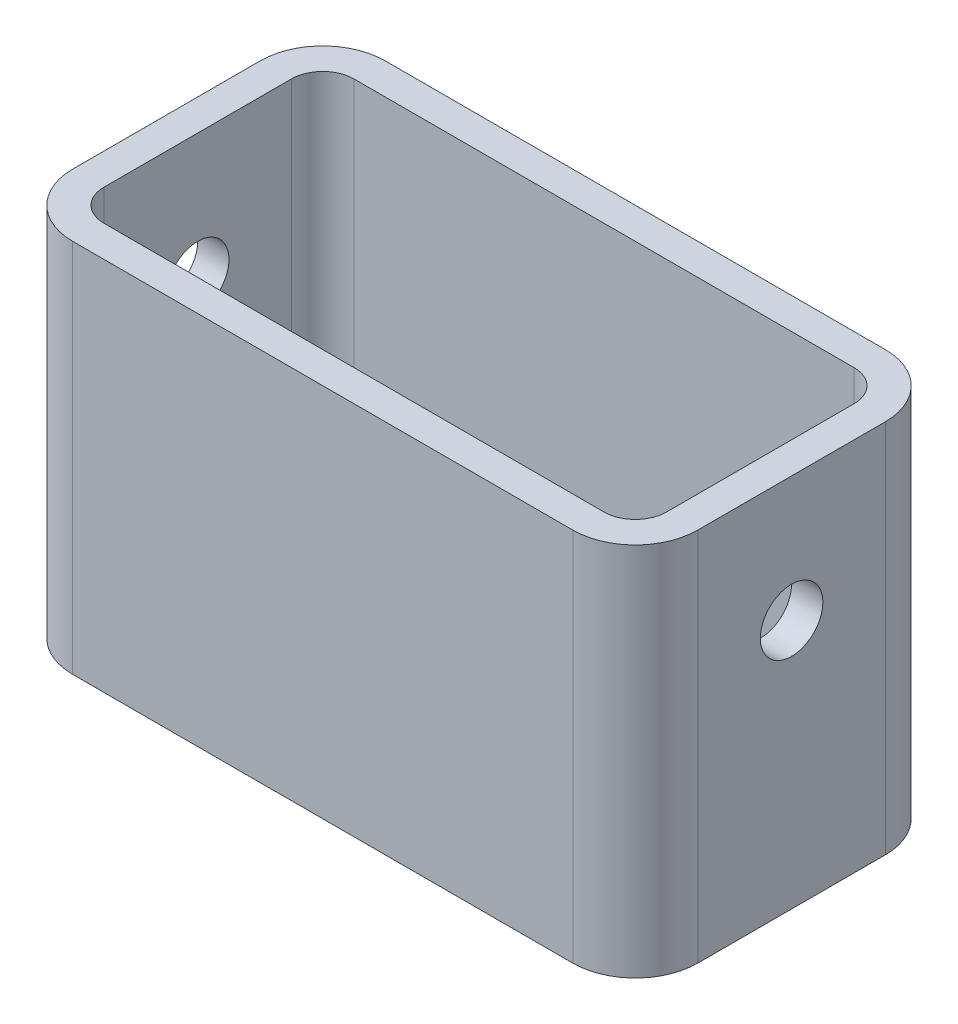
ISO-10303-21;
HEADER;
FILE_DESCRIPTION(('STEP AP214'),'2;1');
FILE_NAME('part.step','',(''),(''),'','','');
FILE_SCHEMA(('AUTOMOTIVE_DESIGN { 1 0 10303 214 1 1 1 1 }'));
ENDSEC;
DATA;
#1=APPLICATION_CONTEXT('core data for automotive mechanical design processes');
#2=APPLICATION_PROTOCOL_DEFINITION('international standard','automotive_design',2000,#1);
#3=PRODUCT_CONTEXT('',#1,'mechanical');
#4=PRODUCT('Part','Part','',(#3));
#5=PRODUCT_RELATED_PRODUCT_CATEGORY('part','',(#4));
#6=PRODUCT_DEFINITION_FORMATION('','',#4);
#7=PRODUCT_DEFINITION_CONTEXT('part definition',#1,'design');
#8=PRODUCT_DEFINITION('design','',#6,#7);
#9=PRODUCT_DEFINITION_SHAPE('','',#8);
#10=(LENGTH_UNIT() NAMED_UNIT(*) SI_UNIT(.MILLI.,.METRE.));
#11=(NAMED_UNIT(*) PLANE_ANGLE_UNIT() SI_UNIT($,.RADIAN.));
#12=(NAMED_UNIT(*) SI_UNIT($,.STERADIAN.) SOLID_ANGLE_UNIT());
#13=UNCERTAINTY_MEASURE_WITH_UNIT(LENGTH_MEASURE(1.E-05),#10,'distance_accuracy_value','');
#14=(GEOMETRIC_REPRESENTATION_CONTEXT(3) GLOBAL_UNCERTAINTY_ASSIGNED_CONTEXT((#13)) GLOBAL_UNIT_ASSIGNED_CONTEXT((#10,
#11,#12)) REPRESENTATION_CONTEXT('',''));
#15=CARTESIAN_POINT('',(0.,0.,0.));
#16=DIRECTION('',(0.,0.,1.));
#17=DIRECTION('',(1.,0.,0.));
#18=AXIS2_PLACEMENT_3D('',#15,#16,#17);
#19=CARTESIAN_POINT('',(0.,60.,0.));
#20=DIRECTION('',(1.,0.,0.));
#21=DIRECTION('',(0.,0.,-1.));
#22=AXIS2_PLACEMENT_3D('',#19,#20,#21);
#23=PLANE('',#22);
#24=CARTESIAN_POINT('',(0.,40.,-25.));
#25=DIRECTION('',(-1.,0.,0.));
#26=DIRECTION('',(0.,0.,1.));
#27=AXIS2_PLACEMENT_3D('',#24,#25,#26);
#28=CIRCLE('',#27,5.);
#29=CARTESIAN_POINT('',(0.,40.,-20.));
#30=VERTEX_POINT('',#29);
#31=EDGE_CURVE('E324',#30,#30,#28,.T.);
#32=ORIENTED_EDGE('',*,*,#31,.F.);
#33=EDGE_LOOP('',(#32));
#34=FACE_BOUND('',#33,.T.);
#35=DIRECTION('',(0.,0.,1.));
#36=VECTOR('',#35,1.);
#37=CARTESIAN_POINT('',(0.,0.,0.));
#38=LINE('',#37,#36);
#39=CARTESIAN_POINT('',(0.,0.,-40.));
#40=VERTEX_POINT('',#39);
#41=CARTESIAN_POINT('',(0.,0.,-10.));
#42=VERTEX_POINT('',#41);
#43=EDGE_CURVE('E163',#40,#42,#38,.T.);
#44=ORIENTED_EDGE('',*,*,#43,.T.);
#45=DIRECTION('',(0.,-1.,0.));
#46=VECTOR('',#45,1.);
#47=CARTESIAN_POINT('',(0.,60.,-10.));
#48=LINE('',#47,#46);
#49=CARTESIAN_POINT('',(0.,60.,-10.));
#50=VERTEX_POINT('',#49);
#51=EDGE_CURVE('E267',#42,#50,#48,.F.);
#52=ORIENTED_EDGE('',*,*,#51,.T.);
#53=DIRECTION('',(0.,0.,1.));
#54=VECTOR('',#53,1.);
#55=CARTESIAN_POINT('',(0.,60.,0.));
#56=LINE('',#55,#54);
#57=CARTESIAN_POINT('',(0.,60.,-40.));
#58=VERTEX_POINT('',#57);
#59=EDGE_CURVE('E228',#58,#50,#56,.T.);
#60=ORIENTED_EDGE('',*,*,#59,.F.);
#61=DIRECTION('',(0.,-1.,0.));
#62=VECTOR('',#61,1.);
#63=CARTESIAN_POINT('',(0.,60.,-40.));
#64=LINE('',#63,#62);
#65=EDGE_CURVE('E264',#58,#40,#64,.T.);
#66=ORIENTED_EDGE('',*,*,#65,.T.);
#67=EDGE_LOOP('',(#44,#52,#60,#66));
#68=FACE_BOUND('',#67,.T.);
#69=ADVANCED_FACE('F34',(#34,#68),#23,.F.);
#70=CARTESIAN_POINT('',(0.,60.,0.));
#71=DIRECTION('',(0.,0.,-1.));
#72=DIRECTION('',(-1.,0.,0.));
#73=AXIS2_PLACEMENT_3D('',#70,#71,#72);
#74=PLANE('',#73);
#75=DIRECTION('',(1.,0.,0.));
#76=VECTOR('',#75,1.);
#77=CARTESIAN_POINT('',(0.,60.,0.));
#78=LINE('',#77,#76);
#79=CARTESIAN_POINT('',(10.,60.,0.));
#80=VERTEX_POINT('',#79);
#81=CARTESIAN_POINT('',(90.,60.,0.));
#82=VERTEX_POINT('',#81);
#83=EDGE_CURVE('E231',#80,#82,#78,.T.);
#84=ORIENTED_EDGE('',*,*,#83,.F.);
#85=DIRECTION('',(0.,-1.,0.));
#86=VECTOR('',#85,1.);
#87=CARTESIAN_POINT('',(10.,60.,0.));
#88=LINE('',#87,#86);
#89=CARTESIAN_POINT('',(10.,0.,0.));
#90=VERTEX_POINT('',#89);
#91=EDGE_CURVE('E253',#80,#90,#88,.T.);
#92=ORIENTED_EDGE('',*,*,#91,.T.);
#93=DIRECTION('',(1.,0.,0.));
#94=VECTOR('',#93,1.);
#95=CARTESIAN_POINT('',(0.,0.,0.));
#96=LINE('',#95,#94);
#97=CARTESIAN_POINT('',(90.,0.,0.));
#98=VERTEX_POINT('',#97);
#99=EDGE_CURVE('E244',#90,#98,#96,.T.);
#100=ORIENTED_EDGE('',*,*,#99,.T.);
#101=DIRECTION('',(0.,-1.,0.));
#102=VECTOR('',#101,1.);
#103=CARTESIAN_POINT('',(90.,60.,0.));
#104=LINE('',#103,#102);
#105=EDGE_CURVE('E241',#98,#82,#104,.F.);
#106=ORIENTED_EDGE('',*,*,#105,.T.);
#107=EDGE_LOOP('',(#84,#92,#100,#106));
#108=FACE_BOUND('',#107,.T.);
#109=ADVANCED_FACE('F361',(#108),#74,.F.);
#110=CARTESIAN_POINT('',(100.,60.,0.));
#111=DIRECTION('',(-1.,0.,0.));
#112=DIRECTION('',(0.,0.,1.));
#113=AXIS2_PLACEMENT_3D('',#110,#111,#112);
#114=PLANE('',#113);
#115=CARTESIAN_POINT('',(100.,40.,-25.));
#116=DIRECTION('',(-1.,0.,0.));
#117=DIRECTION('',(0.,0.,1.));
#118=AXIS2_PLACEMENT_3D('',#115,#116,#117);
#119=CIRCLE('',#118,5.);
#120=CARTESIAN_POINT('',(100.,40.,-20.));
#121=VERTEX_POINT('',#120);
#122=EDGE_CURVE('E327',#121,#121,#119,.T.);
#123=ORIENTED_EDGE('',*,*,#122,.T.);
#124=EDGE_LOOP('',(#123));
#125=FACE_BOUND('',#124,.T.);
#126=DIRECTION('',(0.,0.,-1.));
#127=VECTOR('',#126,1.);
#128=CARTESIAN_POINT('',(100.,60.,0.));
#129=LINE('',#128,#127);
#130=CARTESIAN_POINT('',(100.,60.,-10.));
#131=VERTEX_POINT('',#130);
#132=CARTESIAN_POINT('',(100.,60.,-40.));
#133=VERTEX_POINT('',#132);
#134=EDGE_CURVE('E235',#131,#133,#129,.T.);
#135=ORIENTED_EDGE('',*,*,#134,.F.);
#136=DIRECTION('',(0.,-1.,0.));
#137=VECTOR('',#136,1.);
#138=CARTESIAN_POINT('',(100.,60.,-10.));
#139=LINE('',#138,#137);
#140=CARTESIAN_POINT('',(100.,0.,-10.));
#141=VERTEX_POINT('',#140);
#142=EDGE_CURVE('E284',#131,#141,#139,.T.);
#143=ORIENTED_EDGE('',*,*,#142,.T.);
#144=DIRECTION('',(0.,0.,-1.));
#145=VECTOR('',#144,1.);
#146=CARTESIAN_POINT('',(100.,0.,0.));
#147=LINE('',#146,#145);
#148=CARTESIAN_POINT('',(100.,0.,-40.));
#149=VERTEX_POINT('',#148);
#150=EDGE_CURVE('E247',#141,#149,#147,.T.);
#151=ORIENTED_EDGE('',*,*,#150,.T.);
#152=DIRECTION('',(0.,-1.,0.));
#153=VECTOR('',#152,1.);
#154=CARTESIAN_POINT('',(100.,60.,-40.));
#155=LINE('',#154,#153);
#156=EDGE_CURVE('E282',#149,#133,#155,.F.);
#157=ORIENTED_EDGE('',*,*,#156,.T.);
#158=EDGE_LOOP('',(#135,#143,#151,#157));
#159=FACE_BOUND('',#158,.T.);
#160=ADVANCED_FACE('F367',(#125,#159),#114,.F.);
#161=CARTESIAN_POINT('',(0.,60.,-50.));
#162=DIRECTION('',(0.,0.,1.));
#163=DIRECTION('',(1.,0.,0.));
#164=AXIS2_PLACEMENT_3D('',#161,#162,#163);
#165=PLANE('',#164);
#166=DIRECTION('',(-1.,0.,0.));
#167=VECTOR('',#166,1.);
#168=CARTESIAN_POINT('',(0.,0.,-50.));
#169=LINE('',#168,#167);
#170=CARTESIAN_POINT('',(90.,0.,-50.));
#171=VERTEX_POINT('',#170);
#172=CARTESIAN_POINT('',(10.,0.,-50.));
#173=VERTEX_POINT('',#172);
#174=EDGE_CURVE('E232',#171,#173,#169,.T.);
#175=ORIENTED_EDGE('',*,*,#174,.T.);
#176=DIRECTION('',(0.,-1.,0.));
#177=VECTOR('',#176,1.);
#178=CARTESIAN_POINT('',(10.,60.,-50.));
#179=LINE('',#178,#177);
#180=CARTESIAN_POINT('',(10.,60.,-50.));
#181=VERTEX_POINT('',#180);
#182=EDGE_CURVE('E280',#173,#181,#179,.F.);
#183=ORIENTED_EDGE('',*,*,#182,.T.);
#184=DIRECTION('',(-1.,0.,0.));
#185=VECTOR('',#184,1.);
#186=CARTESIAN_POINT('',(0.,60.,-50.));
#187=LINE('',#186,#185);
#188=CARTESIAN_POINT('',(90.,60.,-50.));
#189=VERTEX_POINT('',#188);
#190=EDGE_CURVE('E238',#189,#181,#187,.T.);
#191=ORIENTED_EDGE('',*,*,#190,.F.);
#192=DIRECTION('',(0.,-1.,0.));
#193=VECTOR('',#192,1.);
#194=CARTESIAN_POINT('',(90.,60.,-50.));
#195=LINE('',#194,#193);
#196=EDGE_CURVE('E277',#189,#171,#195,.T.);
#197=ORIENTED_EDGE('',*,*,#196,.T.);
#198=EDGE_LOOP('',(#175,#183,#191,#197));
#199=FACE_BOUND('',#198,.T.);
#200=ADVANCED_FACE('F398',(#199),#165,.F.);
#201=CARTESIAN_POINT('',(0.,60.,0.));
#202=DIRECTION('',(0.,-1.,0.));
#203=DIRECTION('',(0.,0.,-1.));
#204=AXIS2_PLACEMENT_3D('',#201,#202,#203);
#205=PLANE('',#204);
#206=DIRECTION('',(0.,0.,1.));
#207=VECTOR('',#206,1.);
#208=CARTESIAN_POINT('',(5.,60.,-40.));
#209=LINE('',#208,#207);
#210=CARTESIAN_POINT('',(5.,60.,-40.));
#211=VERTEX_POINT('',#210);
#212=CARTESIAN_POINT('',(5.,60.,-10.));
#213=VERTEX_POINT('',#212);
#214=EDGE_CURVE('E50',#211,#213,#209,.T.);
#215=ORIENTED_EDGE('',*,*,#214,.F.);
#216=CARTESIAN_POINT('',(10.,60.,-40.));
#217=DIRECTION('',(0.,1.,0.));
#218=DIRECTION('',(0.,0.,1.));
#219=AXIS2_PLACEMENT_3D('',#216,#217,#218);
#220=CIRCLE('',#219,5.);
#221=CARTESIAN_POINT('',(10.,60.,-45.));
#222=VERTEX_POINT('',#221);
#223=EDGE_CURVE('E206',#222,#211,#220,.T.);
#224=ORIENTED_EDGE('',*,*,#223,.F.);
#225=DIRECTION('',(-1.,0.,0.));
#226=VECTOR('',#225,1.);
#227=CARTESIAN_POINT('',(90.,60.,-45.));
#228=LINE('',#227,#226);
#229=CARTESIAN_POINT('',(90.,60.,-45.));
#230=VERTEX_POINT('',#229);
#231=EDGE_CURVE('E196',#230,#222,#228,.T.);
#232=ORIENTED_EDGE('',*,*,#231,.F.);
#233=CARTESIAN_POINT('',(90.,60.,-40.));
#234=DIRECTION('',(0.,1.,0.));
#235=DIRECTION('',(0.,0.,1.));
#236=AXIS2_PLACEMENT_3D('',#233,#234,#235);
#237=CIRCLE('',#236,5.);
#238=CARTESIAN_POINT('',(95.,60.,-40.));
#239=VERTEX_POINT('',#238);
#240=EDGE_CURVE('E186',#239,#230,#237,.T.);
#241=ORIENTED_EDGE('',*,*,#240,.F.);
#242=DIRECTION('',(0.,0.,-1.));
#243=VECTOR('',#242,1.);
#244=CARTESIAN_POINT('',(95.,60.,-10.));
#245=LINE('',#244,#243);
#246=CARTESIAN_POINT('',(95.,60.,-10.));
#247=VERTEX_POINT('',#246);
#248=EDGE_CURVE('E177',#247,#239,#245,.T.);
#249=ORIENTED_EDGE('',*,*,#248,.F.);
#250=CARTESIAN_POINT('',(90.,60.,-10.));
#251=DIRECTION('',(0.,1.,0.));
#252=DIRECTION('',(0.,0.,1.));
#253=AXIS2_PLACEMENT_3D('',#250,#251,#252);
#254=CIRCLE('',#253,5.);
#255=CARTESIAN_POINT('',(90.,60.,-5.));
#256=VERTEX_POINT('',#255);
#257=EDGE_CURVE('E156',#256,#247,#254,.T.);
#258=ORIENTED_EDGE('',*,*,#257,.F.);
#259=DIRECTION('',(1.,0.,0.));
#260=VECTOR('',#259,1.);
#261=CARTESIAN_POINT('',(10.,60.,-5.));
#262=LINE('',#261,#260);
#263=CARTESIAN_POINT('',(10.,60.,-5.));
#264=VERTEX_POINT('',#263);
#265=EDGE_CURVE('E151',#264,#256,#262,.T.);
#266=ORIENTED_EDGE('',*,*,#265,.F.);
#267=CARTESIAN_POINT('',(10.,60.,-10.));
#268=DIRECTION('',(0.,1.,0.));
#269=DIRECTION('',(0.,0.,1.));
#270=AXIS2_PLACEMENT_3D('',#267,#268,#269);
#271=CIRCLE('',#270,5.);
#272=EDGE_CURVE('E159',#213,#264,#271,.T.);
#273=ORIENTED_EDGE('',*,*,#272,.F.);
#274=EDGE_LOOP('',(#215,#224,#232,#241,#249,#258,#266,#273));
#275=FACE_BOUND('',#274,.T.);
#276=ORIENTED_EDGE('',*,*,#59,.T.);
#277=CARTESIAN_POINT('',(10.,60.,-10.));
#278=DIRECTION('',(0.,-1.,0.));
#279=DIRECTION('',(0.,0.,-1.));
#280=AXIS2_PLACEMENT_3D('',#277,#278,#279);
#281=CIRCLE('',#280,10.);
#282=EDGE_CURVE('E275',#50,#80,#281,.F.);
#283=ORIENTED_EDGE('',*,*,#282,.T.);
#284=ORIENTED_EDGE('',*,*,#83,.T.);
#285=CARTESIAN_POINT('',(90.,60.,-10.));
#286=DIRECTION('',(0.,-1.,0.));
#287=DIRECTION('',(0.,0.,-1.));
#288=AXIS2_PLACEMENT_3D('',#285,#286,#287);
#289=CIRCLE('',#288,10.);
#290=EDGE_CURVE('E271',#82,#131,#289,.F.);
#291=ORIENTED_EDGE('',*,*,#290,.T.);
#292=ORIENTED_EDGE('',*,*,#134,.T.);
#293=CARTESIAN_POINT('',(90.,60.,-40.));
#294=DIRECTION('',(0.,-1.,0.));
#295=DIRECTION('',(0.,0.,-1.));
#296=AXIS2_PLACEMENT_3D('',#293,#294,#295);
#297=CIRCLE('',#296,10.);
#298=EDGE_CURVE('E269',#133,#189,#297,.F.);
#299=ORIENTED_EDGE('',*,*,#298,.T.);
#300=ORIENTED_EDGE('',*,*,#190,.T.);
#301=CARTESIAN_POINT('',(10.,60.,-40.));
#302=DIRECTION('',(0.,-1.,0.));
#303=DIRECTION('',(0.,0.,-1.));
#304=AXIS2_PLACEMENT_3D('',#301,#302,#303);
#305=CIRCLE('',#304,10.);
#306=EDGE_CURVE('E273',#181,#58,#305,.F.);
#307=ORIENTED_EDGE('',*,*,#306,.T.);
#308=EDGE_LOOP('',(#276,#283,#284,#291,#292,#299,#300,#307));
#309=FACE_BOUND('',#308,.T.);
#310=ADVANCED_FACE('F165',(#275,#309),#205,.F.);
#311=CARTESIAN_POINT('',(0.,0.,0.));
#312=DIRECTION('',(0.,-1.,0.));
#313=DIRECTION('',(0.,0.,-1.));
#314=AXIS2_PLACEMENT_3D('',#311,#312,#313);
#315=PLANE('',#314);
#316=CARTESIAN_POINT('',(10.,0.,-40.));
#317=DIRECTION('',(0.,-1.,0.));
#318=DIRECTION('',(0.,0.,-1.));
#319=AXIS2_PLACEMENT_3D('',#316,#317,#318);
#320=CIRCLE('',#319,5.);
#321=CARTESIAN_POINT('',(10.,0.,-45.));
#322=VERTEX_POINT('',#321);
#323=CARTESIAN_POINT('',(5.,0.,-40.));
#324=VERTEX_POINT('',#323);
#325=EDGE_CURVE('E43',#322,#324,#320,.F.);
#326=ORIENTED_EDGE('',*,*,#325,.T.);
#327=DIRECTION('',(0.,0.,1.));
#328=VECTOR('',#327,1.);
#329=CARTESIAN_POINT('',(5.,0.,0.));
#330=LINE('',#329,#328);
#331=CARTESIAN_POINT('',(5.,0.,-10.));
#332=VERTEX_POINT('',#331);
#333=EDGE_CURVE('E12',#324,#332,#330,.T.);
#334=ORIENTED_EDGE('',*,*,#333,.T.);
#335=CARTESIAN_POINT('',(10.,0.,-10.));
#336=DIRECTION('',(0.,-1.,0.));
#337=DIRECTION('',(0.,0.,-1.));
#338=AXIS2_PLACEMENT_3D('',#335,#336,#337);
#339=CIRCLE('',#338,5.);
#340=CARTESIAN_POINT('',(10.,0.,-5.));
#341=VERTEX_POINT('',#340);
#342=EDGE_CURVE('E287',#332,#341,#339,.F.);
#343=ORIENTED_EDGE('',*,*,#342,.T.);
#344=DIRECTION('',(1.,0.,0.));
#345=VECTOR('',#344,1.);
#346=CARTESIAN_POINT('',(0.,0.,-5.));
#347=LINE('',#346,#345);
#348=CARTESIAN_POINT('',(90.,0.,-5.));
#349=VERTEX_POINT('',#348);
#350=EDGE_CURVE('E154',#341,#349,#347,.T.);
#351=ORIENTED_EDGE('',*,*,#350,.T.);
#352=CARTESIAN_POINT('',(90.,0.,-10.));
#353=DIRECTION('',(0.,-1.,0.));
#354=DIRECTION('',(0.,0.,-1.));
#355=AXIS2_PLACEMENT_3D('',#352,#353,#354);
#356=CIRCLE('',#355,5.);
#357=CARTESIAN_POINT('',(95.,0.,-10.));
#358=VERTEX_POINT('',#357);
#359=EDGE_CURVE('E290',#349,#358,#356,.F.);
#360=ORIENTED_EDGE('',*,*,#359,.T.);
#361=DIRECTION('',(0.,0.,-1.));
#362=VECTOR('',#361,1.);
#363=CARTESIAN_POINT('',(95.,0.,0.));
#364=LINE('',#363,#362);
#365=CARTESIAN_POINT('',(95.,0.,-40.));
#366=VERTEX_POINT('',#365);
#367=EDGE_CURVE('E293',#358,#366,#364,.T.);
#368=ORIENTED_EDGE('',*,*,#367,.T.);
#369=CARTESIAN_POINT('',(90.,0.,-40.));
#370=DIRECTION('',(0.,-1.,0.));
#371=DIRECTION('',(0.,0.,-1.));
#372=AXIS2_PLACEMENT_3D('',#369,#370,#371);
#373=CIRCLE('',#372,5.);
#374=CARTESIAN_POINT('',(90.,0.,-45.));
#375=VERTEX_POINT('',#374);
#376=EDGE_CURVE('E296',#366,#375,#373,.F.);
#377=ORIENTED_EDGE('',*,*,#376,.T.);
#378=DIRECTION('',(-1.,0.,0.));
#379=VECTOR('',#378,1.);
#380=CARTESIAN_POINT('',(0.,0.,-45.));
#381=LINE('',#380,#379);
#382=EDGE_CURVE('E299',#375,#322,#381,.T.);
#383=ORIENTED_EDGE('',*,*,#382,.T.);
#384=EDGE_LOOP('',(#326,#334,#343,#351,#360,#368,#377,#383));
#385=FACE_BOUND('',#384,.T.);
#386=ORIENTED_EDGE('',*,*,#99,.F.);
#387=CARTESIAN_POINT('',(10.,0.,-10.));
#388=DIRECTION('',(0.,-1.,0.));
#389=DIRECTION('',(0.,0.,-1.));
#390=AXIS2_PLACEMENT_3D('',#387,#388,#389);
#391=CIRCLE('',#390,10.);
#392=EDGE_CURVE('E262',#90,#42,#391,.T.);
#393=ORIENTED_EDGE('',*,*,#392,.T.);
#394=ORIENTED_EDGE('',*,*,#43,.F.);
#395=CARTESIAN_POINT('',(10.,0.,-40.));
#396=DIRECTION('',(0.,-1.,0.));
#397=DIRECTION('',(0.,0.,-1.));
#398=AXIS2_PLACEMENT_3D('',#395,#396,#397);
#399=CIRCLE('',#398,10.);
#400=EDGE_CURVE('E260',#40,#173,#399,.T.);
#401=ORIENTED_EDGE('',*,*,#400,.T.);
#402=ORIENTED_EDGE('',*,*,#174,.F.);
#403=CARTESIAN_POINT('',(90.,0.,-40.));
#404=DIRECTION('',(0.,-1.,0.));
#405=DIRECTION('',(0.,0.,-1.));
#406=AXIS2_PLACEMENT_3D('',#403,#404,#405);
#407=CIRCLE('',#406,10.);
#408=EDGE_CURVE('E256',#171,#149,#407,.T.);
#409=ORIENTED_EDGE('',*,*,#408,.T.);
#410=ORIENTED_EDGE('',*,*,#150,.F.);
#411=CARTESIAN_POINT('',(90.,0.,-10.));
#412=DIRECTION('',(0.,-1.,0.));
#413=DIRECTION('',(0.,0.,-1.));
#414=AXIS2_PLACEMENT_3D('',#411,#412,#413);
#415=CIRCLE('',#414,10.);
#416=EDGE_CURVE('E258',#141,#98,#415,.T.);
#417=ORIENTED_EDGE('',*,*,#416,.T.);
#418=EDGE_LOOP('',(#386,#393,#394,#401,#402,#409,#410,#417));
#419=FACE_BOUND('',#418,.T.);
#420=ADVANCED_FACE('F304',(#385,#419),#315,.T.);
#421=CARTESIAN_POINT('',(10.,60.,-10.));
#422=DIRECTION('',(0.,-1.,0.));
#423=DIRECTION('',(0.,0.,-1.));
#424=AXIS2_PLACEMENT_3D('',#421,#422,#423);
#425=CYLINDRICAL_SURFACE('',#424,10.);
#426=ORIENTED_EDGE('',*,*,#282,.F.);
#427=ORIENTED_EDGE('',*,*,#51,.F.);
#428=ORIENTED_EDGE('',*,*,#392,.F.);
#429=ORIENTED_EDGE('',*,*,#91,.F.);
#430=EDGE_LOOP('',(#426,#427,#428,#429));
#431=FACE_BOUND('',#430,.T.);
#432=ADVANCED_FACE('F374',(#431),#425,.T.);
#433=CARTESIAN_POINT('',(10.,60.,-40.));
#434=DIRECTION('',(0.,-1.,0.));
#435=DIRECTION('',(0.,0.,-1.));
#436=AXIS2_PLACEMENT_3D('',#433,#434,#435);
#437=CYLINDRICAL_SURFACE('',#436,10.);
#438=ORIENTED_EDGE('',*,*,#306,.F.);
#439=ORIENTED_EDGE('',*,*,#182,.F.);
#440=ORIENTED_EDGE('',*,*,#400,.F.);
#441=ORIENTED_EDGE('',*,*,#65,.F.);
#442=EDGE_LOOP('',(#438,#439,#440,#441));
#443=FACE_BOUND('',#442,.T.);
#444=ADVANCED_FACE('F377',(#443),#437,.T.);
#445=CARTESIAN_POINT('',(90.,60.,-10.));
#446=DIRECTION('',(0.,-1.,0.));
#447=DIRECTION('',(0.,0.,-1.));
#448=AXIS2_PLACEMENT_3D('',#445,#446,#447);
#449=CYLINDRICAL_SURFACE('',#448,10.);
#450=ORIENTED_EDGE('',*,*,#290,.F.);
#451=ORIENTED_EDGE('',*,*,#105,.F.);
#452=ORIENTED_EDGE('',*,*,#416,.F.);
#453=ORIENTED_EDGE('',*,*,#142,.F.);
#454=EDGE_LOOP('',(#450,#451,#452,#453));
#455=FACE_BOUND('',#454,.T.);
#456=ADVANCED_FACE('F354',(#455),#449,.T.);
#457=CARTESIAN_POINT('',(90.,60.,-40.));
#458=DIRECTION('',(0.,-1.,0.));
#459=DIRECTION('',(0.,0.,-1.));
#460=AXIS2_PLACEMENT_3D('',#457,#458,#459);
#461=CYLINDRICAL_SURFACE('',#460,10.);
#462=ORIENTED_EDGE('',*,*,#298,.F.);
#463=ORIENTED_EDGE('',*,*,#156,.F.);
#464=ORIENTED_EDGE('',*,*,#408,.F.);
#465=ORIENTED_EDGE('',*,*,#196,.F.);
#466=EDGE_LOOP('',(#462,#463,#464,#465));
#467=FACE_BOUND('',#466,.T.);
#468=ADVANCED_FACE('F36',(#467),#461,.T.);
#469=CARTESIAN_POINT('',(5.,60.,-40.));
#470=DIRECTION('',(1.,0.,0.));
#471=DIRECTION('',(0.,0.,-1.));
#472=AXIS2_PLACEMENT_3D('',#469,#470,#471);
#473=PLANE('',#472);
#474=CARTESIAN_POINT('',(5.,40.,-25.));
#475=DIRECTION('',(1.,0.,0.));
#476=DIRECTION('',(0.,0.,-1.));
#477=AXIS2_PLACEMENT_3D('',#474,#475,#476);
#478=CIRCLE('',#477,5.);
#479=CARTESIAN_POINT('',(5.,40.,-30.));
#480=VERTEX_POINT('',#479);
#481=EDGE_CURVE('E225',#480,#480,#478,.T.);
#482=ORIENTED_EDGE('',*,*,#481,.F.);
#483=EDGE_LOOP('',(#482));
#484=FACE_BOUND('',#483,.T.);
#485=DIRECTION('',(0.,-1.,0.));
#486=VECTOR('',#485,1.);
#487=CARTESIAN_POINT('',(5.,60.,-40.));
#488=LINE('',#487,#486);
#489=EDGE_CURVE('E222',#211,#324,#488,.T.);
#490=ORIENTED_EDGE('',*,*,#489,.F.);
#491=ORIENTED_EDGE('',*,*,#214,.T.);
#492=DIRECTION('',(0.,-1.,0.));
#493=VECTOR('',#492,1.);
#494=CARTESIAN_POINT('',(5.,60.,-10.));
#495=LINE('',#494,#493);
#496=EDGE_CURVE('E161',#213,#332,#495,.T.);
#497=ORIENTED_EDGE('',*,*,#496,.T.);
#498=ORIENTED_EDGE('',*,*,#333,.F.);
#499=EDGE_LOOP('',(#490,#491,#497,#498));
#500=FACE_BOUND('',#499,.T.);
#501=ADVANCED_FACE('F345',(#484,#500),#473,.T.);
#502=CARTESIAN_POINT('',(10.,60.,-40.));
#503=DIRECTION('',(0.,-1.,0.));
#504=DIRECTION('',(0.,0.,-1.));
#505=AXIS2_PLACEMENT_3D('',#502,#503,#504);
#506=CYLINDRICAL_SURFACE('',#505,5.);
#507=DIRECTION('',(0.,-1.,0.));
#508=VECTOR('',#507,1.);
#509=CARTESIAN_POINT('',(10.,60.,-45.));
#510=LINE('',#509,#508);
#511=EDGE_CURVE('E213',#222,#322,#510,.T.);
#512=ORIENTED_EDGE('',*,*,#511,.F.);
#513=ORIENTED_EDGE('',*,*,#223,.T.);
#514=ORIENTED_EDGE('',*,*,#489,.T.);
#515=ORIENTED_EDGE('',*,*,#325,.F.);
#516=EDGE_LOOP('',(#512,#513,#514,#515));
#517=FACE_BOUND('',#516,.T.);
#518=ADVANCED_FACE('F307',(#517),#506,.F.);
#519=CARTESIAN_POINT('',(90.,60.,-45.));
#520=DIRECTION('',(0.,0.,1.));
#521=DIRECTION('',(1.,0.,0.));
#522=AXIS2_PLACEMENT_3D('',#519,#520,#521);
#523=PLANE('',#522);
#524=DIRECTION('',(0.,-1.,0.));
#525=VECTOR('',#524,1.);
#526=CARTESIAN_POINT('',(90.,60.,-45.));
#527=LINE('',#526,#525);
#528=EDGE_CURVE('E203',#230,#375,#527,.T.);
#529=ORIENTED_EDGE('',*,*,#528,.F.);
#530=ORIENTED_EDGE('',*,*,#231,.T.);
#531=ORIENTED_EDGE('',*,*,#511,.T.);
#532=ORIENTED_EDGE('',*,*,#382,.F.);
#533=EDGE_LOOP('',(#529,#530,#531,#532));
#534=FACE_BOUND('',#533,.T.);
#535=ADVANCED_FACE('F309',(#534),#523,.T.);
#536=CARTESIAN_POINT('',(90.,60.,-40.));
#537=DIRECTION('',(0.,-1.,0.));
#538=DIRECTION('',(0.,0.,-1.));
#539=AXIS2_PLACEMENT_3D('',#536,#537,#538);
#540=CYLINDRICAL_SURFACE('',#539,5.);
#541=DIRECTION('',(0.,-1.,0.));
#542=VECTOR('',#541,1.);
#543=CARTESIAN_POINT('',(95.,60.,-40.));
#544=LINE('',#543,#542);
#545=EDGE_CURVE('E193',#239,#366,#544,.T.);
#546=ORIENTED_EDGE('',*,*,#545,.F.);
#547=ORIENTED_EDGE('',*,*,#240,.T.);
#548=ORIENTED_EDGE('',*,*,#528,.T.);
#549=ORIENTED_EDGE('',*,*,#376,.F.);
#550=EDGE_LOOP('',(#546,#547,#548,#549));
#551=FACE_BOUND('',#550,.T.);
#552=ADVANCED_FACE('F341',(#551),#540,.F.);
#553=CARTESIAN_POINT('',(95.,60.,-10.));
#554=DIRECTION('',(-1.,0.,0.));
#555=DIRECTION('',(0.,0.,1.));
#556=AXIS2_PLACEMENT_3D('',#553,#554,#555);
#557=PLANE('',#556);
#558=CARTESIAN_POINT('',(95.,40.,-25.));
#559=DIRECTION('',(-1.,0.,0.));
#560=DIRECTION('',(0.,0.,1.));
#561=AXIS2_PLACEMENT_3D('',#558,#559,#560);
#562=CIRCLE('',#561,5.);
#563=CARTESIAN_POINT('',(95.,40.,-20.));
#564=VERTEX_POINT('',#563);
#565=EDGE_CURVE('E38',#564,#564,#562,.T.);
#566=ORIENTED_EDGE('',*,*,#565,.F.);
#567=EDGE_LOOP('',(#566));
#568=FACE_BOUND('',#567,.T.);
#569=DIRECTION('',(0.,-1.,0.));
#570=VECTOR('',#569,1.);
#571=CARTESIAN_POINT('',(95.,60.,-10.));
#572=LINE('',#571,#570);
#573=EDGE_CURVE('E183',#247,#358,#572,.T.);
#574=ORIENTED_EDGE('',*,*,#573,.F.);
#575=ORIENTED_EDGE('',*,*,#248,.T.);
#576=ORIENTED_EDGE('',*,*,#545,.T.);
#577=ORIENTED_EDGE('',*,*,#367,.F.);
#578=EDGE_LOOP('',(#574,#575,#576,#577));
#579=FACE_BOUND('',#578,.T.);
#580=ADVANCED_FACE('F337',(#568,#579),#557,.T.);
#581=CARTESIAN_POINT('',(90.,60.,-10.));
#582=DIRECTION('',(0.,-1.,0.));
#583=DIRECTION('',(0.,0.,-1.));
#584=AXIS2_PLACEMENT_3D('',#581,#582,#583);
#585=CYLINDRICAL_SURFACE('',#584,5.);
#586=DIRECTION('',(0.,-1.,0.));
#587=VECTOR('',#586,1.);
#588=CARTESIAN_POINT('',(90.,60.,-5.));
#589=LINE('',#588,#587);
#590=EDGE_CURVE('E175',#256,#349,#589,.T.);
#591=ORIENTED_EDGE('',*,*,#590,.F.);
#592=ORIENTED_EDGE('',*,*,#257,.T.);
#593=ORIENTED_EDGE('',*,*,#573,.T.);
#594=ORIENTED_EDGE('',*,*,#359,.F.);
#595=EDGE_LOOP('',(#591,#592,#593,#594));
#596=FACE_BOUND('',#595,.T.);
#597=ADVANCED_FACE('F340',(#596),#585,.F.);
#598=CARTESIAN_POINT('',(10.,60.,-5.));
#599=DIRECTION('',(0.,0.,-1.));
#600=DIRECTION('',(-1.,0.,0.));
#601=AXIS2_PLACEMENT_3D('',#598,#599,#600);
#602=PLANE('',#601);
#603=DIRECTION('',(0.,-1.,0.));
#604=VECTOR('',#603,1.);
#605=CARTESIAN_POINT('',(10.,60.,-5.));
#606=LINE('',#605,#604);
#607=EDGE_CURVE('E58',#264,#341,#606,.T.);
#608=ORIENTED_EDGE('',*,*,#607,.F.);
#609=ORIENTED_EDGE('',*,*,#265,.T.);
#610=ORIENTED_EDGE('',*,*,#590,.T.);
#611=ORIENTED_EDGE('',*,*,#350,.F.);
#612=EDGE_LOOP('',(#608,#609,#610,#611));
#613=FACE_BOUND('',#612,.T.);
#614=ADVANCED_FACE('F148',(#613),#602,.T.);
#615=CARTESIAN_POINT('',(10.,60.,-10.));
#616=DIRECTION('',(0.,-1.,0.));
#617=DIRECTION('',(0.,0.,-1.));
#618=AXIS2_PLACEMENT_3D('',#615,#616,#617);
#619=CYLINDRICAL_SURFACE('',#618,5.);
#620=ORIENTED_EDGE('',*,*,#496,.F.);
#621=ORIENTED_EDGE('',*,*,#272,.T.);
#622=ORIENTED_EDGE('',*,*,#607,.T.);
#623=ORIENTED_EDGE('',*,*,#342,.F.);
#624=EDGE_LOOP('',(#620,#621,#622,#623));
#625=FACE_BOUND('',#624,.T.);
#626=ADVANCED_FACE('F160',(#625),#619,.F.);
#627=CARTESIAN_POINT('',(100.,40.,-25.));
#628=DIRECTION('',(-1.,0.,0.));
#629=DIRECTION('',(0.,0.,1.));
#630=AXIS2_PLACEMENT_3D('',#627,#628,#629);
#631=CYLINDRICAL_SURFACE('',#630,5.);
#632=ORIENTED_EDGE('',*,*,#565,.T.);
#633=EDGE_LOOP('',(#632));
#634=FACE_BOUND('',#633,.T.);
#635=ORIENTED_EDGE('',*,*,#122,.F.);
#636=EDGE_LOOP('',(#635));
#637=FACE_BOUND('',#636,.T.);
#638=ADVANCED_FACE('F334',(#634,#637),#631,.F.);
#639=ORIENTED_EDGE('',*,*,#481,.T.);
#640=EDGE_LOOP('',(#639));
#641=FACE_BOUND('',#640,.T.);
#642=ORIENTED_EDGE('',*,*,#31,.T.);
#643=EDGE_LOOP('',(#642));
#644=FACE_BOUND('',#643,.T.);
#645=ADVANCED_FACE('F359',(#641,#644),#631,.F.);
#646=CLOSED_SHELL('',(#69,#109,#160,#200,#310,#420,#432,#444,#456,#468,#501,#518,#535,#552,#580,
#597,#614,#626,#638,#645));
#647=MANIFOLD_SOLID_BREP('B2',#646);
#648=ADVANCED_BREP_SHAPE_REPRESENTATION('',(#18,#647),#14);
#649=SHAPE_DEFINITION_REPRESENTATION(#9,#648);
ENDSEC;
END-ISO-10303-21;
